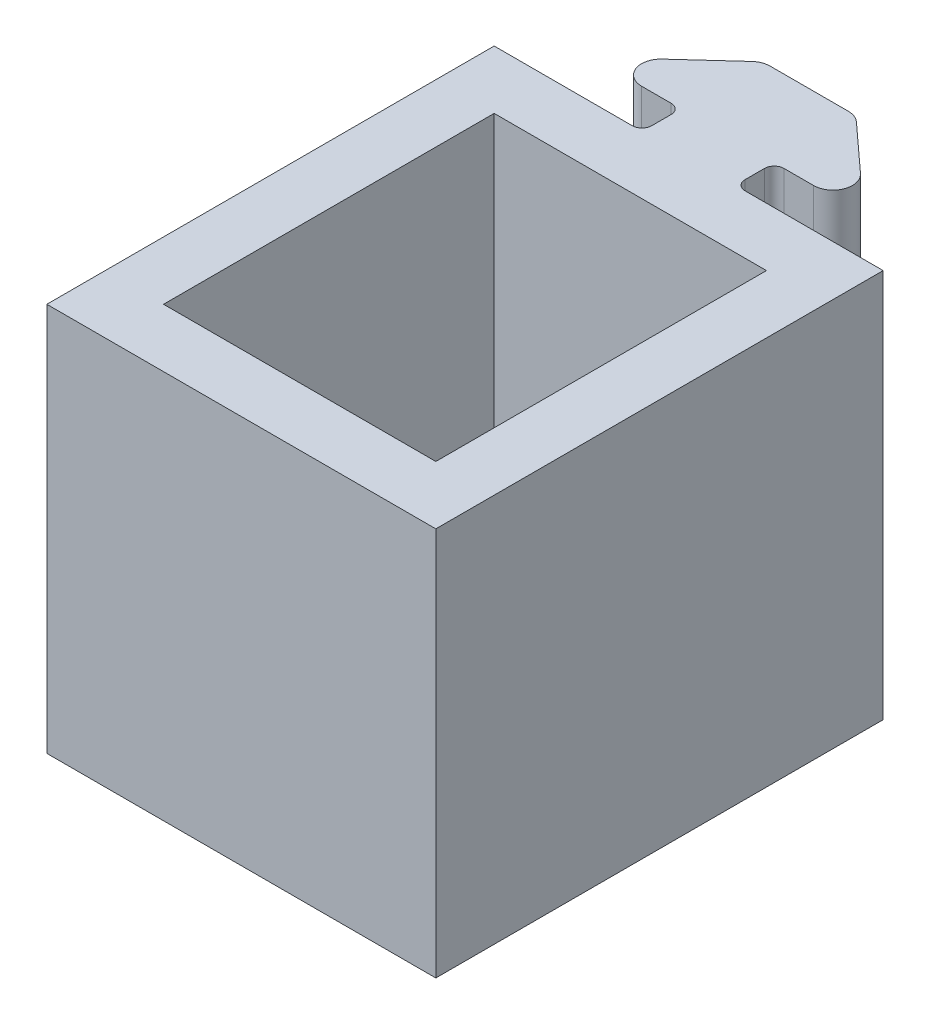
ISO-10303-21;
HEADER;
FILE_DESCRIPTION(('STEP AP214'),'2;1');
FILE_NAME('part.step','',(''),(''),'','','');
FILE_SCHEMA(('AUTOMOTIVE_DESIGN { 1 0 10303 214 1 1 1 1 }'));
ENDSEC;
DATA;
#1=APPLICATION_CONTEXT('core data for automotive mechanical design processes');
#2=APPLICATION_PROTOCOL_DEFINITION('international standard','automotive_design',2000,#1);
#3=PRODUCT_CONTEXT('',#1,'mechanical');
#4=PRODUCT('Part','Part','',(#3));
#5=PRODUCT_RELATED_PRODUCT_CATEGORY('part','',(#4));
#6=PRODUCT_DEFINITION_FORMATION('','',#4);
#7=PRODUCT_DEFINITION_CONTEXT('part definition',#1,'design');
#8=PRODUCT_DEFINITION('design','',#6,#7);
#9=PRODUCT_DEFINITION_SHAPE('','',#8);
#10=(LENGTH_UNIT() NAMED_UNIT(*) SI_UNIT(.MILLI.,.METRE.));
#11=(NAMED_UNIT(*) PLANE_ANGLE_UNIT() SI_UNIT($,.RADIAN.));
#12=(NAMED_UNIT(*) SI_UNIT($,.STERADIAN.) SOLID_ANGLE_UNIT());
#13=UNCERTAINTY_MEASURE_WITH_UNIT(LENGTH_MEASURE(1.E-05),#10,'distance_accuracy_value','');
#14=(GEOMETRIC_REPRESENTATION_CONTEXT(3) GLOBAL_UNCERTAINTY_ASSIGNED_CONTEXT((#13)) GLOBAL_UNIT_ASSIGNED_CONTEXT((#10,
#11,#12)) REPRESENTATION_CONTEXT('',''));
#15=CARTESIAN_POINT('',(0.,0.,0.));
#16=DIRECTION('',(0.,0.,1.));
#17=DIRECTION('',(1.,0.,0.));
#18=AXIS2_PLACEMENT_3D('',#15,#16,#17);
#19=CARTESIAN_POINT('',(10.,20.,4.61818181818181));
#20=DIRECTION('',(0.,0.,-1.));
#21=DIRECTION('',(-1.,0.,0.));
#22=AXIS2_PLACEMENT_3D('',#19,#20,#21);
#23=PLANE('',#22);
#24=DIRECTION('',(0.,1.,0.));
#25=VECTOR('',#24,1.);
#26=CARTESIAN_POINT('',(-7.,0.,4.61818181818181));
#27=LINE('',#26,#25);
#28=CARTESIAN_POINT('',(-7.,0.,4.61818181818181));
#29=VERTEX_POINT('',#28);
#30=CARTESIAN_POINT('',(-7.,20.,4.61818181818181));
#31=VERTEX_POINT('',#30);
#32=EDGE_CURVE('E235',#29,#31,#27,.T.);
#33=ORIENTED_EDGE('',*,*,#32,.F.);
#34=DIRECTION('',(1.,0.,0.));
#35=VECTOR('',#34,1.);
#36=CARTESIAN_POINT('',(10.,0.,4.61818181818181));
#37=LINE('',#36,#35);
#38=CARTESIAN_POINT('',(7.,0.,4.61818181818181));
#39=VERTEX_POINT('',#38);
#40=EDGE_CURVE('E289',#29,#39,#37,.T.);
#41=ORIENTED_EDGE('',*,*,#40,.T.);
#42=DIRECTION('',(0.,1.,0.));
#43=VECTOR('',#42,1.);
#44=CARTESIAN_POINT('',(7.,0.,4.61818181818181));
#45=LINE('',#44,#43);
#46=CARTESIAN_POINT('',(7.,20.,4.61818181818181));
#47=VERTEX_POINT('',#46);
#48=EDGE_CURVE('E48',#39,#47,#45,.T.);
#49=ORIENTED_EDGE('',*,*,#48,.T.);
#50=DIRECTION('',(1.,0.,0.));
#51=VECTOR('',#50,1.);
#52=CARTESIAN_POINT('',(10.,20.,4.61818181818181));
#53=LINE('',#52,#51);
#54=EDGE_CURVE('E52',#31,#47,#53,.T.);
#55=ORIENTED_EDGE('',*,*,#54,.F.);
#56=EDGE_LOOP('',(#33,#41,#49,#55));
#57=FACE_BOUND('',#56,.T.);
#58=ADVANCED_FACE('F33',(#57),#23,.F.);
#59=CARTESIAN_POINT('',(2.4,20.,-4.58181818181819));
#60=DIRECTION('',(-0.674269364021332,0.,0.738485493928126));
#61=DIRECTION('',(0.738485493928126,0.,0.674269364021332));
#62=AXIS2_PLACEMENT_3D('',#59,#60,#61);
#63=PLANE('',#62);
#64=DIRECTION('',(-0.738485493928126,0.,-0.674269364021332));
#65=VECTOR('',#64,1.);
#66=CARTESIAN_POINT('',(2.4,0.,-4.58181818181819));
#67=LINE('',#66,#65);
#68=CARTESIAN_POINT('',(5.0959444590311,0.,-2.12030367574631));
#69=VERTEX_POINT('',#68);
#70=CARTESIAN_POINT('',(2.68642064950729,0.,-4.32030367574631));
#71=VERTEX_POINT('',#70);
#72=EDGE_CURVE('E231',#69,#71,#67,.T.);
#73=ORIENTED_EDGE('',*,*,#72,.T.);
#74=DIRECTION('',(0.,-1.,0.));
#75=VECTOR('',#74,1.);
#76=CARTESIAN_POINT('',(2.68642064950729,20.,-4.32030367574631));
#77=LINE('',#76,#75);
#78=CARTESIAN_POINT('',(2.68642064950729,20.,-4.32030367574631));
#79=VERTEX_POINT('',#78);
#80=EDGE_CURVE('E322',#71,#79,#77,.F.);
#81=ORIENTED_EDGE('',*,*,#80,.T.);
#82=DIRECTION('',(-0.738485493928126,0.,-0.674269364021332));
#83=VECTOR('',#82,1.);
#84=CARTESIAN_POINT('',(2.4,20.,-4.58181818181819));
#85=LINE('',#84,#83);
#86=CARTESIAN_POINT('',(5.0959444590311,20.,-2.12030367574631));
#87=VERTEX_POINT('',#86);
#88=EDGE_CURVE('E239',#87,#79,#85,.T.);
#89=ORIENTED_EDGE('',*,*,#88,.F.);
#90=DIRECTION('',(0.,-1.,0.));
#91=VECTOR('',#90,1.);
#92=CARTESIAN_POINT('',(5.0959444590311,20.,-2.12030367574631));
#93=LINE('',#92,#91);
#94=EDGE_CURVE('E319',#87,#69,#93,.T.);
#95=ORIENTED_EDGE('',*,*,#94,.T.);
#96=EDGE_LOOP('',(#73,#81,#89,#95));
#97=FACE_BOUND('',#96,.T.);
#98=ADVANCED_FACE('F443',(#97),#63,.F.);
#99=CARTESIAN_POINT('',(-2.4,20.,-4.58181818181819));
#100=DIRECTION('',(0.,0.,1.));
#101=DIRECTION('',(1.,0.,0.));
#102=AXIS2_PLACEMENT_3D('',#99,#100,#101);
#103=PLANE('',#102);
#104=DIRECTION('',(-1.,0.,0.));
#105=VECTOR('',#104,1.);
#106=CARTESIAN_POINT('',(-2.4,20.,-4.58181818181819));
#107=LINE('',#106,#105);
#108=CARTESIAN_POINT('',(2.01215128548596,20.,-4.58181818181819));
#109=VERTEX_POINT('',#108);
#110=CARTESIAN_POINT('',(-2.01215128548596,20.,-4.58181818181819));
#111=VERTEX_POINT('',#110);
#112=EDGE_CURVE('E242',#109,#111,#107,.T.);
#113=ORIENTED_EDGE('',*,*,#112,.F.);
#114=DIRECTION('',(0.,-1.,0.));
#115=VECTOR('',#114,1.);
#116=CARTESIAN_POINT('',(2.01215128548596,20.,-4.58181818181819));
#117=LINE('',#116,#115);
#118=CARTESIAN_POINT('',(2.01215128548596,0.,-4.58181818181819));
#119=VERTEX_POINT('',#118);
#120=EDGE_CURVE('E307',#109,#119,#117,.T.);
#121=ORIENTED_EDGE('',*,*,#120,.T.);
#122=DIRECTION('',(-1.,0.,0.));
#123=VECTOR('',#122,1.);
#124=CARTESIAN_POINT('',(-2.4,0.,-4.58181818181819));
#125=LINE('',#124,#123);
#126=CARTESIAN_POINT('',(-2.01215128548596,0.,-4.58181818181819));
#127=VERTEX_POINT('',#126);
#128=EDGE_CURVE('E273',#119,#127,#125,.T.);
#129=ORIENTED_EDGE('',*,*,#128,.T.);
#130=DIRECTION('',(0.,-1.,0.));
#131=VECTOR('',#130,1.);
#132=CARTESIAN_POINT('',(-2.01215128548596,20.,-4.58181818181819));
#133=LINE('',#132,#131);
#134=EDGE_CURVE('E305',#127,#111,#133,.F.);
#135=ORIENTED_EDGE('',*,*,#134,.T.);
#136=EDGE_LOOP('',(#113,#121,#129,#135));
#137=FACE_BOUND('',#136,.T.);
#138=ADVANCED_FACE('F454',(#137),#103,.F.);
#139=CARTESIAN_POINT('',(-2.4,20.,-4.58181818181819));
#140=DIRECTION('',(0.674269364021332,0.,0.738485493928126));
#141=DIRECTION('',(0.738485493928126,0.,-0.674269364021332));
#142=AXIS2_PLACEMENT_3D('',#139,#140,#141);
#143=PLANE('',#142);
#144=DIRECTION('',(-0.738485493928126,0.,0.674269364021332));
#145=VECTOR('',#144,1.);
#146=CARTESIAN_POINT('',(-2.4,20.,-4.58181818181819));
#147=LINE('',#146,#145);
#148=CARTESIAN_POINT('',(-2.68642064950729,20.,-4.32030367574631));
#149=VERTEX_POINT('',#148);
#150=CARTESIAN_POINT('',(-5.0959444590311,20.,-2.12030367574631));
#151=VERTEX_POINT('',#150);
#152=EDGE_CURVE('E246',#149,#151,#147,.T.);
#153=ORIENTED_EDGE('',*,*,#152,.F.);
#154=DIRECTION('',(0.,-1.,0.));
#155=VECTOR('',#154,1.);
#156=CARTESIAN_POINT('',(-2.68642064950729,20.,-4.32030367574631));
#157=LINE('',#156,#155);
#158=CARTESIAN_POINT('',(-2.68642064950729,0.,-4.32030367574631));
#159=VERTEX_POINT('',#158);
#160=EDGE_CURVE('E334',#149,#159,#157,.T.);
#161=ORIENTED_EDGE('',*,*,#160,.T.);
#162=DIRECTION('',(-0.738485493928126,0.,0.674269364021332));
#163=VECTOR('',#162,1.);
#164=CARTESIAN_POINT('',(-2.4,0.,-4.58181818181819));
#165=LINE('',#164,#163);
#166=CARTESIAN_POINT('',(-5.0959444590311,0.,-2.12030367574631));
#167=VERTEX_POINT('',#166);
#168=EDGE_CURVE('E276',#159,#167,#165,.T.);
#169=ORIENTED_EDGE('',*,*,#168,.T.);
#170=DIRECTION('',(0.,-1.,0.));
#171=VECTOR('',#170,1.);
#172=CARTESIAN_POINT('',(-5.0959444590311,20.,-2.12030367574631));
#173=LINE('',#172,#171);
#174=EDGE_CURVE('E332',#167,#151,#173,.F.);
#175=ORIENTED_EDGE('',*,*,#174,.T.);
#176=EDGE_LOOP('',(#153,#161,#169,#175));
#177=FACE_BOUND('',#176,.T.);
#178=ADVANCED_FACE('F462',(#177),#143,.F.);
#179=CARTESIAN_POINT('',(-7.,20.,-0.381818181818188));
#180=DIRECTION('',(0.,0.,-1.));
#181=DIRECTION('',(-1.,0.,0.));
#182=AXIS2_PLACEMENT_3D('',#179,#180,#181);
#183=PLANE('',#182);
#184=DIRECTION('',(1.,0.,0.));
#185=VECTOR('',#184,1.);
#186=CARTESIAN_POINT('',(-7.,0.,-0.381818181818188));
#187=LINE('',#186,#185);
#188=CARTESIAN_POINT('',(-4.42167509500977,0.,-0.381818181818187));
#189=VERTEX_POINT('',#188);
#190=CARTESIAN_POINT('',(-2.9,0.,-0.381818181818187));
#191=VERTEX_POINT('',#190);
#192=EDGE_CURVE('E279',#189,#191,#187,.T.);
#193=ORIENTED_EDGE('',*,*,#192,.T.);
#194=DIRECTION('',(0.,-1.,0.));
#195=VECTOR('',#194,1.);
#196=CARTESIAN_POINT('',(-2.9,20.,-0.381818181818187));
#197=LINE('',#196,#195);
#198=CARTESIAN_POINT('',(-2.9,20.,-0.381818181818187));
#199=VERTEX_POINT('',#198);
#200=EDGE_CURVE('E361',#191,#199,#197,.F.);
#201=ORIENTED_EDGE('',*,*,#200,.T.);
#202=DIRECTION('',(1.,0.,0.));
#203=VECTOR('',#202,1.);
#204=CARTESIAN_POINT('',(-7.,20.,-0.381818181818188));
#205=LINE('',#204,#203);
#206=CARTESIAN_POINT('',(-4.42167509500977,20.,-0.381818181818187));
#207=VERTEX_POINT('',#206);
#208=EDGE_CURVE('E249',#207,#199,#205,.T.);
#209=ORIENTED_EDGE('',*,*,#208,.F.);
#210=DIRECTION('',(0.,-1.,0.));
#211=VECTOR('',#210,1.);
#212=CARTESIAN_POINT('',(-4.42167509500977,20.,-0.381818181818187));
#213=LINE('',#212,#211);
#214=EDGE_CURVE('E337',#207,#189,#213,.T.);
#215=ORIENTED_EDGE('',*,*,#214,.T.);
#216=EDGE_LOOP('',(#193,#201,#209,#215));
#217=FACE_BOUND('',#216,.T.);
#218=ADVANCED_FACE('F381',(#217),#183,.F.);
#219=CARTESIAN_POINT('',(-2.4,20.,-0.381818181818187));
#220=DIRECTION('',(1.,0.,0.));
#221=DIRECTION('',(0.,0.,-1.));
#222=AXIS2_PLACEMENT_3D('',#219,#220,#221);
#223=PLANE('',#222);
#224=DIRECTION('',(0.,0.,1.));
#225=VECTOR('',#224,1.);
#226=CARTESIAN_POINT('',(-2.4,0.,-0.381818181818187));
#227=LINE('',#226,#225);
#228=CARTESIAN_POINT('',(-2.4,0.,0.118181818181813));
#229=VERTEX_POINT('',#228);
#230=CARTESIAN_POINT('',(-2.4,0.,1.11818181818181));
#231=VERTEX_POINT('',#230);
#232=EDGE_CURVE('E282',#229,#231,#227,.T.);
#233=ORIENTED_EDGE('',*,*,#232,.T.);
#234=DIRECTION('',(0.,-1.,0.));
#235=VECTOR('',#234,1.);
#236=CARTESIAN_POINT('',(-2.4,20.,1.11818181818181));
#237=LINE('',#236,#235);
#238=CARTESIAN_POINT('',(-2.4,20.,1.11818181818181));
#239=VERTEX_POINT('',#238);
#240=EDGE_CURVE('E359',#231,#239,#237,.F.);
#241=ORIENTED_EDGE('',*,*,#240,.T.);
#242=DIRECTION('',(0.,0.,1.));
#243=VECTOR('',#242,1.);
#244=CARTESIAN_POINT('',(-2.4,20.,-0.381818181818187));
#245=LINE('',#244,#243);
#246=CARTESIAN_POINT('',(-2.4,20.,0.118181818181813));
#247=VERTEX_POINT('',#246);
#248=EDGE_CURVE('E252',#247,#239,#245,.T.);
#249=ORIENTED_EDGE('',*,*,#248,.F.);
#250=DIRECTION('',(0.,-1.,0.));
#251=VECTOR('',#250,1.);
#252=CARTESIAN_POINT('',(-2.4,0.,0.118181818181813));
#253=LINE('',#252,#251);
#254=EDGE_CURVE('E356',#247,#229,#253,.T.);
#255=ORIENTED_EDGE('',*,*,#254,.T.);
#256=EDGE_LOOP('',(#233,#241,#249,#255));
#257=FACE_BOUND('',#256,.T.);
#258=ADVANCED_FACE('F391',(#257),#223,.F.);
#259=CARTESIAN_POINT('',(-2.4,20.,1.61818181818181));
#260=DIRECTION('',(0.,0.,1.));
#261=DIRECTION('',(1.,0.,0.));
#262=AXIS2_PLACEMENT_3D('',#259,#260,#261);
#263=PLANE('',#262);
#264=DIRECTION('',(-1.,0.,0.));
#265=VECTOR('',#264,1.);
#266=CARTESIAN_POINT('',(-2.4,20.,1.61818181818181));
#267=LINE('',#266,#265);
#268=CARTESIAN_POINT('',(-2.9,20.,1.61818181818181));
#269=VERTEX_POINT('',#268);
#270=CARTESIAN_POINT('',(-10.,20.,1.61818181818181));
#271=VERTEX_POINT('',#270);
#272=EDGE_CURVE('E255',#269,#271,#267,.T.);
#273=ORIENTED_EDGE('',*,*,#272,.F.);
#274=DIRECTION('',(0.,-1.,0.));
#275=VECTOR('',#274,1.);
#276=CARTESIAN_POINT('',(-2.9,0.,1.61818181818181));
#277=LINE('',#276,#275);
#278=CARTESIAN_POINT('',(-2.9,0.,1.61818181818181));
#279=VERTEX_POINT('',#278);
#280=EDGE_CURVE('E353',#269,#279,#277,.T.);
#281=ORIENTED_EDGE('',*,*,#280,.T.);
#282=DIRECTION('',(-1.,0.,0.));
#283=VECTOR('',#282,1.);
#284=CARTESIAN_POINT('',(-2.4,0.,1.61818181818181));
#285=LINE('',#284,#283);
#286=CARTESIAN_POINT('',(-10.,0.,1.61818181818181));
#287=VERTEX_POINT('',#286);
#288=EDGE_CURVE('E285',#279,#287,#285,.T.);
#289=ORIENTED_EDGE('',*,*,#288,.T.);
#290=DIRECTION('',(0.,-1.,0.));
#291=VECTOR('',#290,1.);
#292=CARTESIAN_POINT('',(-10.,20.,1.61818181818181));
#293=LINE('',#292,#291);
#294=EDGE_CURVE('E302',#271,#287,#293,.T.);
#295=ORIENTED_EDGE('',*,*,#294,.F.);
#296=EDGE_LOOP('',(#273,#281,#289,#295));
#297=FACE_BOUND('',#296,.T.);
#298=ADVANCED_FACE('F399',(#297),#263,.F.);
#299=CARTESIAN_POINT('',(-10.,20.,1.61818181818181));
#300=DIRECTION('',(1.,0.,0.));
#301=DIRECTION('',(0.,0.,-1.));
#302=AXIS2_PLACEMENT_3D('',#299,#300,#301);
#303=PLANE('',#302);
#304=DIRECTION('',(0.,0.,1.));
#305=VECTOR('',#304,1.);
#306=CARTESIAN_POINT('',(-10.,0.,1.61818181818181));
#307=LINE('',#306,#305);
#308=CARTESIAN_POINT('',(-10.,0.,24.6181818181818));
#309=VERTEX_POINT('',#308);
#310=EDGE_CURVE('E287',#287,#309,#307,.T.);
#311=ORIENTED_EDGE('',*,*,#310,.T.);
#312=DIRECTION('',(0.,1.,0.));
#313=VECTOR('',#312,1.);
#314=CARTESIAN_POINT('',(-10.,0.,24.6181818181818));
#315=LINE('',#314,#313);
#316=CARTESIAN_POINT('',(-10.,20.,24.6181818181818));
#317=VERTEX_POINT('',#316);
#318=EDGE_CURVE('E232',#309,#317,#315,.T.);
#319=ORIENTED_EDGE('',*,*,#318,.T.);
#320=DIRECTION('',(0.,0.,1.));
#321=VECTOR('',#320,1.);
#322=CARTESIAN_POINT('',(-10.,20.,1.61818181818181));
#323=LINE('',#322,#321);
#324=EDGE_CURVE('E257',#271,#317,#323,.T.);
#325=ORIENTED_EDGE('',*,*,#324,.F.);
#326=ORIENTED_EDGE('',*,*,#294,.T.);
#327=EDGE_LOOP('',(#311,#319,#325,#326));
#328=FACE_BOUND('',#327,.T.);
#329=ADVANCED_FACE('F404',(#328),#303,.F.);
#330=CARTESIAN_POINT('',(10.,20.,1.61818181818181));
#331=DIRECTION('',(-1.,0.,0.));
#332=DIRECTION('',(0.,0.,1.));
#333=AXIS2_PLACEMENT_3D('',#330,#331,#332);
#334=PLANE('',#333);
#335=DIRECTION('',(0.,0.,-1.));
#336=VECTOR('',#335,1.);
#337=CARTESIAN_POINT('',(10.,0.,1.61818181818181));
#338=LINE('',#337,#336);
#339=CARTESIAN_POINT('',(10.,0.,24.6181818181818));
#340=VERTEX_POINT('',#339);
#341=CARTESIAN_POINT('',(10.,0.,1.61818181818181));
#342=VERTEX_POINT('',#341);
#343=EDGE_CURVE('E291',#340,#342,#338,.T.);
#344=ORIENTED_EDGE('',*,*,#343,.T.);
#345=DIRECTION('',(0.,-1.,0.));
#346=VECTOR('',#345,1.);
#347=CARTESIAN_POINT('',(10.,20.,1.61818181818181));
#348=LINE('',#347,#346);
#349=CARTESIAN_POINT('',(10.,20.,1.61818181818181));
#350=VERTEX_POINT('',#349);
#351=EDGE_CURVE('E270',#350,#342,#348,.T.);
#352=ORIENTED_EDGE('',*,*,#351,.F.);
#353=DIRECTION('',(0.,0.,-1.));
#354=VECTOR('',#353,1.);
#355=CARTESIAN_POINT('',(10.,20.,1.61818181818181));
#356=LINE('',#355,#354);
#357=CARTESIAN_POINT('',(10.,20.,24.6181818181818));
#358=VERTEX_POINT('',#357);
#359=EDGE_CURVE('E260',#358,#350,#356,.T.);
#360=ORIENTED_EDGE('',*,*,#359,.F.);
#361=DIRECTION('',(0.,1.,0.));
#362=VECTOR('',#361,1.);
#363=CARTESIAN_POINT('',(10.,0.,24.6181818181818));
#364=LINE('',#363,#362);
#365=EDGE_CURVE('E228',#340,#358,#364,.T.);
#366=ORIENTED_EDGE('',*,*,#365,.F.);
#367=EDGE_LOOP('',(#344,#352,#360,#366));
#368=FACE_BOUND('',#367,.T.);
#369=ADVANCED_FACE('F413',(#368),#334,.F.);
#370=CARTESIAN_POINT('',(2.4,20.,1.61818181818181));
#371=DIRECTION('',(0.,0.,1.));
#372=DIRECTION('',(1.,0.,0.));
#373=AXIS2_PLACEMENT_3D('',#370,#371,#372);
#374=PLANE('',#373);
#375=DIRECTION('',(-1.,0.,0.));
#376=VECTOR('',#375,1.);
#377=CARTESIAN_POINT('',(2.4,0.,1.61818181818181));
#378=LINE('',#377,#376);
#379=CARTESIAN_POINT('',(2.9,0.,1.61818181818181));
#380=VERTEX_POINT('',#379);
#381=EDGE_CURVE('E293',#342,#380,#378,.T.);
#382=ORIENTED_EDGE('',*,*,#381,.T.);
#383=DIRECTION('',(0.,-1.,0.));
#384=VECTOR('',#383,1.);
#385=CARTESIAN_POINT('',(2.9,20.,1.61818181818181));
#386=LINE('',#385,#384);
#387=CARTESIAN_POINT('',(2.9,20.,1.61818181818181));
#388=VERTEX_POINT('',#387);
#389=EDGE_CURVE('E348',#380,#388,#386,.F.);
#390=ORIENTED_EDGE('',*,*,#389,.T.);
#391=DIRECTION('',(-1.,0.,0.));
#392=VECTOR('',#391,1.);
#393=CARTESIAN_POINT('',(2.4,20.,1.61818181818181));
#394=LINE('',#393,#392);
#395=EDGE_CURVE('E262',#350,#388,#394,.T.);
#396=ORIENTED_EDGE('',*,*,#395,.F.);
#397=ORIENTED_EDGE('',*,*,#351,.T.);
#398=EDGE_LOOP('',(#382,#390,#396,#397));
#399=FACE_BOUND('',#398,.T.);
#400=ADVANCED_FACE('F417',(#399),#374,.F.);
#401=CARTESIAN_POINT('',(2.4,20.,-0.381818181818187));
#402=DIRECTION('',(-1.,0.,0.));
#403=DIRECTION('',(0.,0.,1.));
#404=AXIS2_PLACEMENT_3D('',#401,#402,#403);
#405=PLANE('',#404);
#406=DIRECTION('',(0.,0.,-1.));
#407=VECTOR('',#406,1.);
#408=CARTESIAN_POINT('',(2.4,20.,-0.381818181818187));
#409=LINE('',#408,#407);
#410=CARTESIAN_POINT('',(2.4,20.,1.11818181818181));
#411=VERTEX_POINT('',#410);
#412=CARTESIAN_POINT('',(2.4,20.,0.118181818181813));
#413=VERTEX_POINT('',#412);
#414=EDGE_CURVE('E265',#411,#413,#409,.T.);
#415=ORIENTED_EDGE('',*,*,#414,.F.);
#416=DIRECTION('',(0.,-1.,0.));
#417=VECTOR('',#416,1.);
#418=CARTESIAN_POINT('',(2.4,0.,1.11818181818181));
#419=LINE('',#418,#417);
#420=CARTESIAN_POINT('',(2.4,0.,1.11818181818181));
#421=VERTEX_POINT('',#420);
#422=EDGE_CURVE('E345',#411,#421,#419,.T.);
#423=ORIENTED_EDGE('',*,*,#422,.T.);
#424=DIRECTION('',(0.,0.,-1.));
#425=VECTOR('',#424,1.);
#426=CARTESIAN_POINT('',(2.4,0.,-0.381818181818187));
#427=LINE('',#426,#425);
#428=CARTESIAN_POINT('',(2.4,0.,0.118181818181813));
#429=VERTEX_POINT('',#428);
#430=EDGE_CURVE('E296',#421,#429,#427,.T.);
#431=ORIENTED_EDGE('',*,*,#430,.T.);
#432=DIRECTION('',(0.,-1.,0.));
#433=VECTOR('',#432,1.);
#434=CARTESIAN_POINT('',(2.4,20.,0.118181818181813));
#435=LINE('',#434,#433);
#436=EDGE_CURVE('E343',#429,#413,#435,.F.);
#437=ORIENTED_EDGE('',*,*,#436,.T.);
#438=EDGE_LOOP('',(#415,#423,#431,#437));
#439=FACE_BOUND('',#438,.T.);
#440=ADVANCED_FACE('F426',(#439),#405,.F.);
#441=CARTESIAN_POINT('',(7.,20.,-0.381818181818188));
#442=DIRECTION('',(0.,0.,-1.));
#443=DIRECTION('',(-1.,0.,0.));
#444=AXIS2_PLACEMENT_3D('',#441,#442,#443);
#445=PLANE('',#444);
#446=DIRECTION('',(1.,0.,0.));
#447=VECTOR('',#446,1.);
#448=CARTESIAN_POINT('',(7.,20.,-0.381818181818188));
#449=LINE('',#448,#447);
#450=CARTESIAN_POINT('',(2.9,20.,-0.381818181818187));
#451=VERTEX_POINT('',#450);
#452=CARTESIAN_POINT('',(4.42167509500977,20.,-0.381818181818187));
#453=VERTEX_POINT('',#452);
#454=EDGE_CURVE('E268',#451,#453,#449,.T.);
#455=ORIENTED_EDGE('',*,*,#454,.F.);
#456=DIRECTION('',(0.,-1.,0.));
#457=VECTOR('',#456,1.);
#458=CARTESIAN_POINT('',(2.9,0.,-0.381818181818187));
#459=LINE('',#458,#457);
#460=CARTESIAN_POINT('',(2.9,0.,-0.381818181818187));
#461=VERTEX_POINT('',#460);
#462=EDGE_CURVE('E350',#451,#461,#459,.T.);
#463=ORIENTED_EDGE('',*,*,#462,.T.);
#464=DIRECTION('',(1.,0.,0.));
#465=VECTOR('',#464,1.);
#466=CARTESIAN_POINT('',(7.,0.,-0.381818181818188));
#467=LINE('',#466,#465);
#468=CARTESIAN_POINT('',(4.42167509500977,0.,-0.381818181818187));
#469=VERTEX_POINT('',#468);
#470=EDGE_CURVE('E243',#461,#469,#467,.T.);
#471=ORIENTED_EDGE('',*,*,#470,.T.);
#472=DIRECTION('',(0.,-1.,0.));
#473=VECTOR('',#472,1.);
#474=CARTESIAN_POINT('',(4.42167509500977,20.,-0.381818181818187));
#475=LINE('',#474,#473);
#476=EDGE_CURVE('E340',#469,#453,#475,.F.);
#477=ORIENTED_EDGE('',*,*,#476,.T.);
#478=EDGE_LOOP('',(#455,#463,#471,#477));
#479=FACE_BOUND('',#478,.T.);
#480=ADVANCED_FACE('F435',(#479),#445,.F.);
#481=CARTESIAN_POINT('',(0.,20.,0.));
#482=DIRECTION('',(0.,-1.,0.));
#483=DIRECTION('',(0.,0.,-1.));
#484=AXIS2_PLACEMENT_3D('',#481,#482,#483);
#485=PLANE('',#484);
#486=DIRECTION('',(1.,0.,0.));
#487=VECTOR('',#486,1.);
#488=CARTESIAN_POINT('',(0.,20.,24.6181818181818));
#489=LINE('',#488,#487);
#490=EDGE_CURVE('E214',#317,#358,#489,.T.);
#491=ORIENTED_EDGE('',*,*,#490,.T.);
#492=ORIENTED_EDGE('',*,*,#359,.T.);
#493=ORIENTED_EDGE('',*,*,#395,.T.);
#494=CARTESIAN_POINT('',(2.9,20.,1.11818181818181));
#495=DIRECTION('',(0.,-1.,0.));
#496=DIRECTION('',(0.,0.,-1.));
#497=AXIS2_PLACEMENT_3D('',#494,#495,#496);
#498=CIRCLE('',#497,0.5);
#499=EDGE_CURVE('E365',#388,#411,#498,.T.);
#500=ORIENTED_EDGE('',*,*,#499,.T.);
#501=ORIENTED_EDGE('',*,*,#414,.T.);
#502=CARTESIAN_POINT('',(2.9,20.,0.118181818181813));
#503=DIRECTION('',(0.,-1.,0.));
#504=DIRECTION('',(0.,0.,-1.));
#505=AXIS2_PLACEMENT_3D('',#502,#503,#504);
#506=CIRCLE('',#505,0.5);
#507=EDGE_CURVE('E369',#413,#451,#506,.T.);
#508=ORIENTED_EDGE('',*,*,#507,.T.);
#509=ORIENTED_EDGE('',*,*,#454,.T.);
#510=CARTESIAN_POINT('',(4.42167509500977,20.,-1.38181818181819));
#511=DIRECTION('',(0.,-1.,0.));
#512=DIRECTION('',(0.,0.,-1.));
#513=AXIS2_PLACEMENT_3D('',#510,#511,#512);
#514=CIRCLE('',#513,1.);
#515=EDGE_CURVE('E324',#453,#87,#514,.F.);
#516=ORIENTED_EDGE('',*,*,#515,.T.);
#517=ORIENTED_EDGE('',*,*,#88,.T.);
#518=CARTESIAN_POINT('',(2.01215128548596,20.,-3.58181818181819));
#519=DIRECTION('',(0.,-1.,0.));
#520=DIRECTION('',(0.,0.,-1.));
#521=AXIS2_PLACEMENT_3D('',#518,#519,#520);
#522=CIRCLE('',#521,1.);
#523=EDGE_CURVE('E330',#79,#109,#522,.F.);
#524=ORIENTED_EDGE('',*,*,#523,.T.);
#525=ORIENTED_EDGE('',*,*,#112,.T.);
#526=CARTESIAN_POINT('',(-2.01215128548596,20.,-3.58181818181819));
#527=DIRECTION('',(0.,-1.,0.));
#528=DIRECTION('',(0.,0.,-1.));
#529=AXIS2_PLACEMENT_3D('',#526,#527,#528);
#530=CIRCLE('',#529,1.);
#531=EDGE_CURVE('E328',#111,#149,#530,.F.);
#532=ORIENTED_EDGE('',*,*,#531,.T.);
#533=ORIENTED_EDGE('',*,*,#152,.T.);
#534=CARTESIAN_POINT('',(-4.42167509500977,20.,-1.38181818181819));
#535=DIRECTION('',(0.,-1.,0.));
#536=DIRECTION('',(0.,0.,-1.));
#537=AXIS2_PLACEMENT_3D('',#534,#535,#536);
#538=CIRCLE('',#537,1.);
#539=EDGE_CURVE('E326',#151,#207,#538,.F.);
#540=ORIENTED_EDGE('',*,*,#539,.T.);
#541=ORIENTED_EDGE('',*,*,#208,.T.);
#542=CARTESIAN_POINT('',(-2.9,20.,0.118181818181813));
#543=DIRECTION('',(0.,-1.,0.));
#544=DIRECTION('',(0.,0.,-1.));
#545=AXIS2_PLACEMENT_3D('',#542,#543,#544);
#546=CIRCLE('',#545,0.5);
#547=EDGE_CURVE('E11',#199,#247,#546,.T.);
#548=ORIENTED_EDGE('',*,*,#547,.T.);
#549=ORIENTED_EDGE('',*,*,#248,.T.);
#550=CARTESIAN_POINT('',(-2.9,20.,1.11818181818181));
#551=DIRECTION('',(0.,-1.,0.));
#552=DIRECTION('',(0.,0.,-1.));
#553=AXIS2_PLACEMENT_3D('',#550,#551,#552);
#554=CIRCLE('',#553,0.5);
#555=EDGE_CURVE('E373',#239,#269,#554,.T.);
#556=ORIENTED_EDGE('',*,*,#555,.T.);
#557=ORIENTED_EDGE('',*,*,#272,.T.);
#558=ORIENTED_EDGE('',*,*,#324,.T.);
#559=EDGE_LOOP('',(#491,#492,#493,#500,#501,#508,#509,#516,#517,#524,#525,#532,#533,#540,#541,
#548,#549,#556,#557,#558));
#560=FACE_BOUND('',#559,.T.);
#561=ORIENTED_EDGE('',*,*,#54,.T.);
#562=DIRECTION('',(0.,0.,1.));
#563=VECTOR('',#562,1.);
#564=CARTESIAN_POINT('',(7.,20.,0.));
#565=LINE('',#564,#563);
#566=CARTESIAN_POINT('',(7.,20.,21.6181818181818));
#567=VERTEX_POINT('',#566);
#568=EDGE_CURVE('E224',#47,#567,#565,.T.);
#569=ORIENTED_EDGE('',*,*,#568,.T.);
#570=DIRECTION('',(1.,0.,0.));
#571=VECTOR('',#570,1.);
#572=CARTESIAN_POINT('',(0.,20.,21.6181818181818));
#573=LINE('',#572,#571);
#574=CARTESIAN_POINT('',(-7.,20.,21.6181818181818));
#575=VERTEX_POINT('',#574);
#576=EDGE_CURVE('E207',#575,#567,#573,.T.);
#577=ORIENTED_EDGE('',*,*,#576,.F.);
#578=DIRECTION('',(0.,0.,1.));
#579=VECTOR('',#578,1.);
#580=CARTESIAN_POINT('',(-7.,20.,0.));
#581=LINE('',#580,#579);
#582=EDGE_CURVE('E217',#31,#575,#581,.T.);
#583=ORIENTED_EDGE('',*,*,#582,.F.);
#584=EDGE_LOOP('',(#561,#569,#577,#583));
#585=FACE_BOUND('',#584,.T.);
#586=ADVANCED_FACE('F387',(#560,#585),#485,.F.);
#587=CARTESIAN_POINT('',(0.,0.,0.));
#588=DIRECTION('',(0.,-1.,0.));
#589=DIRECTION('',(0.,0.,-1.));
#590=AXIS2_PLACEMENT_3D('',#587,#588,#589);
#591=PLANE('',#590);
#592=ORIENTED_EDGE('',*,*,#343,.F.);
#593=DIRECTION('',(1.,0.,0.));
#594=VECTOR('',#593,1.);
#595=CARTESIAN_POINT('',(0.,0.,24.6181818181818));
#596=LINE('',#595,#594);
#597=EDGE_CURVE('E221',#309,#340,#596,.T.);
#598=ORIENTED_EDGE('',*,*,#597,.F.);
#599=ORIENTED_EDGE('',*,*,#310,.F.);
#600=ORIENTED_EDGE('',*,*,#288,.F.);
#601=CARTESIAN_POINT('',(-2.9,0.,1.11818181818181));
#602=DIRECTION('',(0.,-1.,0.));
#603=DIRECTION('',(0.,0.,-1.));
#604=AXIS2_PLACEMENT_3D('',#601,#602,#603);
#605=CIRCLE('',#604,0.5);
#606=EDGE_CURVE('E371',#279,#231,#605,.F.);
#607=ORIENTED_EDGE('',*,*,#606,.T.);
#608=ORIENTED_EDGE('',*,*,#232,.F.);
#609=CARTESIAN_POINT('',(-2.9,0.,0.118181818181813));
#610=DIRECTION('',(0.,-1.,0.));
#611=DIRECTION('',(0.,0.,-1.));
#612=AXIS2_PLACEMENT_3D('',#609,#610,#611);
#613=CIRCLE('',#612,0.5);
#614=EDGE_CURVE('E41',#229,#191,#613,.F.);
#615=ORIENTED_EDGE('',*,*,#614,.T.);
#616=ORIENTED_EDGE('',*,*,#192,.F.);
#617=CARTESIAN_POINT('',(-4.42167509500977,0.,-1.38181818181819));
#618=DIRECTION('',(0.,-1.,0.));
#619=DIRECTION('',(0.,0.,-1.));
#620=AXIS2_PLACEMENT_3D('',#617,#618,#619);
#621=CIRCLE('',#620,1.);
#622=EDGE_CURVE('E313',#189,#167,#621,.T.);
#623=ORIENTED_EDGE('',*,*,#622,.T.);
#624=ORIENTED_EDGE('',*,*,#168,.F.);
#625=CARTESIAN_POINT('',(-2.01215128548596,0.,-3.58181818181819));
#626=DIRECTION('',(0.,-1.,0.));
#627=DIRECTION('',(0.,0.,-1.));
#628=AXIS2_PLACEMENT_3D('',#625,#626,#627);
#629=CIRCLE('',#628,1.);
#630=EDGE_CURVE('E315',#159,#127,#629,.T.);
#631=ORIENTED_EDGE('',*,*,#630,.T.);
#632=ORIENTED_EDGE('',*,*,#128,.F.);
#633=CARTESIAN_POINT('',(2.01215128548596,0.,-3.58181818181819));
#634=DIRECTION('',(0.,-1.,0.));
#635=DIRECTION('',(0.,0.,-1.));
#636=AXIS2_PLACEMENT_3D('',#633,#634,#635);
#637=CIRCLE('',#636,1.);
#638=EDGE_CURVE('E317',#119,#71,#637,.T.);
#639=ORIENTED_EDGE('',*,*,#638,.T.);
#640=ORIENTED_EDGE('',*,*,#72,.F.);
#641=CARTESIAN_POINT('',(4.42167509500977,0.,-1.38181818181819));
#642=DIRECTION('',(0.,-1.,0.));
#643=DIRECTION('',(0.,0.,-1.));
#644=AXIS2_PLACEMENT_3D('',#641,#642,#643);
#645=CIRCLE('',#644,1.);
#646=EDGE_CURVE('E310',#69,#469,#645,.T.);
#647=ORIENTED_EDGE('',*,*,#646,.T.);
#648=ORIENTED_EDGE('',*,*,#470,.F.);
#649=CARTESIAN_POINT('',(2.9,0.,0.118181818181813));
#650=DIRECTION('',(0.,-1.,0.));
#651=DIRECTION('',(0.,0.,-1.));
#652=AXIS2_PLACEMENT_3D('',#649,#650,#651);
#653=CIRCLE('',#652,0.5);
#654=EDGE_CURVE('E367',#461,#429,#653,.F.);
#655=ORIENTED_EDGE('',*,*,#654,.T.);
#656=ORIENTED_EDGE('',*,*,#430,.F.);
#657=CARTESIAN_POINT('',(2.9,0.,1.11818181818181));
#658=DIRECTION('',(0.,-1.,0.));
#659=DIRECTION('',(0.,0.,-1.));
#660=AXIS2_PLACEMENT_3D('',#657,#658,#659);
#661=CIRCLE('',#660,0.5);
#662=EDGE_CURVE('E363',#421,#380,#661,.F.);
#663=ORIENTED_EDGE('',*,*,#662,.T.);
#664=ORIENTED_EDGE('',*,*,#381,.F.);
#665=EDGE_LOOP('',(#592,#598,#599,#600,#607,#608,#615,#616,#623,#624,#631,#632,#639,#640,#647,
#648,#655,#656,#663,#664));
#666=FACE_BOUND('',#665,.T.);
#667=DIRECTION('',(0.,0.,1.));
#668=VECTOR('',#667,1.);
#669=CARTESIAN_POINT('',(7.,0.,0.));
#670=LINE('',#669,#668);
#671=CARTESIAN_POINT('',(7.,0.,21.6181818181818));
#672=VERTEX_POINT('',#671);
#673=EDGE_CURVE('E196',#39,#672,#670,.T.);
#674=ORIENTED_EDGE('',*,*,#673,.F.);
#675=ORIENTED_EDGE('',*,*,#40,.F.);
#676=DIRECTION('',(0.,0.,1.));
#677=VECTOR('',#676,1.);
#678=CARTESIAN_POINT('',(-7.,0.,0.));
#679=LINE('',#678,#677);
#680=CARTESIAN_POINT('',(-7.,0.,21.6181818181818));
#681=VERTEX_POINT('',#680);
#682=EDGE_CURVE('E198',#29,#681,#679,.T.);
#683=ORIENTED_EDGE('',*,*,#682,.T.);
#684=DIRECTION('',(1.,0.,0.));
#685=VECTOR('',#684,1.);
#686=CARTESIAN_POINT('',(0.,0.,21.6181818181818));
#687=LINE('',#686,#685);
#688=EDGE_CURVE('E192',#681,#672,#687,.T.);
#689=ORIENTED_EDGE('',*,*,#688,.T.);
#690=EDGE_LOOP('',(#674,#675,#683,#689));
#691=FACE_BOUND('',#690,.T.);
#692=ADVANCED_FACE('F194',(#666,#691),#591,.T.);
#693=CARTESIAN_POINT('',(2.01215128548596,20.,-3.58181818181819));
#694=DIRECTION('',(0.,-1.,0.));
#695=DIRECTION('',(0.,0.,-1.));
#696=AXIS2_PLACEMENT_3D('',#693,#694,#695);
#697=CYLINDRICAL_SURFACE('',#696,1.);
#698=ORIENTED_EDGE('',*,*,#523,.F.);
#699=ORIENTED_EDGE('',*,*,#80,.F.);
#700=ORIENTED_EDGE('',*,*,#638,.F.);
#701=ORIENTED_EDGE('',*,*,#120,.F.);
#702=EDGE_LOOP('',(#698,#699,#700,#701));
#703=FACE_BOUND('',#702,.T.);
#704=ADVANCED_FACE('F449',(#703),#697,.T.);
#705=CARTESIAN_POINT('',(-2.01215128548596,20.,-3.58181818181819));
#706=DIRECTION('',(0.,-1.,0.));
#707=DIRECTION('',(0.,0.,-1.));
#708=AXIS2_PLACEMENT_3D('',#705,#706,#707);
#709=CYLINDRICAL_SURFACE('',#708,1.);
#710=ORIENTED_EDGE('',*,*,#531,.F.);
#711=ORIENTED_EDGE('',*,*,#134,.F.);
#712=ORIENTED_EDGE('',*,*,#630,.F.);
#713=ORIENTED_EDGE('',*,*,#160,.F.);
#714=EDGE_LOOP('',(#710,#711,#712,#713));
#715=FACE_BOUND('',#714,.T.);
#716=ADVANCED_FACE('F457',(#715),#709,.T.);
#717=CARTESIAN_POINT('',(-4.42167509500977,20.,-1.38181818181819));
#718=DIRECTION('',(0.,-1.,0.));
#719=DIRECTION('',(0.,0.,-1.));
#720=AXIS2_PLACEMENT_3D('',#717,#718,#719);
#721=CYLINDRICAL_SURFACE('',#720,1.);
#722=ORIENTED_EDGE('',*,*,#539,.F.);
#723=ORIENTED_EDGE('',*,*,#174,.F.);
#724=ORIENTED_EDGE('',*,*,#622,.F.);
#725=ORIENTED_EDGE('',*,*,#214,.F.);
#726=EDGE_LOOP('',(#722,#723,#724,#725));
#727=FACE_BOUND('',#726,.T.);
#728=ADVANCED_FACE('F466',(#727),#721,.T.);
#729=CARTESIAN_POINT('',(4.42167509500977,20.,-1.38181818181819));
#730=DIRECTION('',(0.,-1.,0.));
#731=DIRECTION('',(0.,0.,-1.));
#732=AXIS2_PLACEMENT_3D('',#729,#730,#731);
#733=CYLINDRICAL_SURFACE('',#732,1.);
#734=ORIENTED_EDGE('',*,*,#515,.F.);
#735=ORIENTED_EDGE('',*,*,#476,.F.);
#736=ORIENTED_EDGE('',*,*,#646,.F.);
#737=ORIENTED_EDGE('',*,*,#94,.F.);
#738=EDGE_LOOP('',(#734,#735,#736,#737));
#739=FACE_BOUND('',#738,.T.);
#740=ADVANCED_FACE('F446',(#739),#733,.T.);
#741=CARTESIAN_POINT('',(2.9,20.,1.11818181818181));
#742=DIRECTION('',(0.,1.,0.));
#743=DIRECTION('',(0.,0.,1.));
#744=AXIS2_PLACEMENT_3D('',#741,#742,#743);
#745=CYLINDRICAL_SURFACE('',#744,0.5);
#746=ORIENTED_EDGE('',*,*,#499,.F.);
#747=ORIENTED_EDGE('',*,*,#389,.F.);
#748=ORIENTED_EDGE('',*,*,#662,.F.);
#749=ORIENTED_EDGE('',*,*,#422,.F.);
#750=EDGE_LOOP('',(#746,#747,#748,#749));
#751=FACE_BOUND('',#750,.T.);
#752=ADVANCED_FACE('F423',(#751),#745,.F.);
#753=CARTESIAN_POINT('',(2.9,20.,0.118181818181813));
#754=DIRECTION('',(0.,1.,0.));
#755=DIRECTION('',(0.,0.,1.));
#756=AXIS2_PLACEMENT_3D('',#753,#754,#755);
#757=CYLINDRICAL_SURFACE('',#756,0.5);
#758=ORIENTED_EDGE('',*,*,#507,.F.);
#759=ORIENTED_EDGE('',*,*,#436,.F.);
#760=ORIENTED_EDGE('',*,*,#654,.F.);
#761=ORIENTED_EDGE('',*,*,#462,.F.);
#762=EDGE_LOOP('',(#758,#759,#760,#761));
#763=FACE_BOUND('',#762,.T.);
#764=ADVANCED_FACE('F432',(#763),#757,.F.);
#765=CARTESIAN_POINT('',(-2.9,20.,1.11818181818181));
#766=DIRECTION('',(0.,1.,0.));
#767=DIRECTION('',(0.,0.,1.));
#768=AXIS2_PLACEMENT_3D('',#765,#766,#767);
#769=CYLINDRICAL_SURFACE('',#768,0.5);
#770=ORIENTED_EDGE('',*,*,#555,.F.);
#771=ORIENTED_EDGE('',*,*,#240,.F.);
#772=ORIENTED_EDGE('',*,*,#606,.F.);
#773=ORIENTED_EDGE('',*,*,#280,.F.);
#774=EDGE_LOOP('',(#770,#771,#772,#773));
#775=FACE_BOUND('',#774,.T.);
#776=ADVANCED_FACE('F394',(#775),#769,.F.);
#777=CARTESIAN_POINT('',(-2.9,20.,0.118181818181813));
#778=DIRECTION('',(0.,1.,0.));
#779=DIRECTION('',(0.,0.,1.));
#780=AXIS2_PLACEMENT_3D('',#777,#778,#779);
#781=CYLINDRICAL_SURFACE('',#780,0.5);
#782=ORIENTED_EDGE('',*,*,#547,.F.);
#783=ORIENTED_EDGE('',*,*,#200,.F.);
#784=ORIENTED_EDGE('',*,*,#614,.F.);
#785=ORIENTED_EDGE('',*,*,#254,.F.);
#786=EDGE_LOOP('',(#782,#783,#784,#785));
#787=FACE_BOUND('',#786,.T.);
#788=ADVANCED_FACE('F35',(#787),#781,.F.);
#789=CARTESIAN_POINT('',(0.,0.,24.6181818181818));
#790=DIRECTION('',(0.,0.,1.));
#791=DIRECTION('',(1.,0.,0.));
#792=AXIS2_PLACEMENT_3D('',#789,#790,#791);
#793=PLANE('',#792);
#794=ORIENTED_EDGE('',*,*,#490,.F.);
#795=ORIENTED_EDGE('',*,*,#318,.F.);
#796=ORIENTED_EDGE('',*,*,#597,.T.);
#797=ORIENTED_EDGE('',*,*,#365,.T.);
#798=EDGE_LOOP('',(#794,#795,#796,#797));
#799=FACE_BOUND('',#798,.T.);
#800=ADVANCED_FACE('F409',(#799),#793,.T.);
#801=CARTESIAN_POINT('',(-7.,0.,0.));
#802=DIRECTION('',(-1.,0.,0.));
#803=DIRECTION('',(0.,0.,1.));
#804=AXIS2_PLACEMENT_3D('',#801,#802,#803);
#805=PLANE('',#804);
#806=ORIENTED_EDGE('',*,*,#582,.T.);
#807=DIRECTION('',(0.,1.,0.));
#808=VECTOR('',#807,1.);
#809=CARTESIAN_POINT('',(-7.,0.,21.6181818181818));
#810=LINE('',#809,#808);
#811=EDGE_CURVE('E211',#681,#575,#810,.T.);
#812=ORIENTED_EDGE('',*,*,#811,.F.);
#813=ORIENTED_EDGE('',*,*,#682,.F.);
#814=ORIENTED_EDGE('',*,*,#32,.T.);
#815=EDGE_LOOP('',(#806,#812,#813,#814));
#816=FACE_BOUND('',#815,.T.);
#817=ADVANCED_FACE('F539',(#816),#805,.F.);
#818=CARTESIAN_POINT('',(0.,0.,21.6181818181818));
#819=DIRECTION('',(0.,0.,1.));
#820=DIRECTION('',(1.,0.,0.));
#821=AXIS2_PLACEMENT_3D('',#818,#819,#820);
#822=PLANE('',#821);
#823=ORIENTED_EDGE('',*,*,#576,.T.);
#824=DIRECTION('',(0.,1.,0.));
#825=VECTOR('',#824,1.);
#826=CARTESIAN_POINT('',(7.,0.,21.6181818181818));
#827=LINE('',#826,#825);
#828=EDGE_CURVE('E204',#672,#567,#827,.T.);
#829=ORIENTED_EDGE('',*,*,#828,.F.);
#830=ORIENTED_EDGE('',*,*,#688,.F.);
#831=ORIENTED_EDGE('',*,*,#811,.T.);
#832=EDGE_LOOP('',(#823,#829,#830,#831));
#833=FACE_BOUND('',#832,.T.);
#834=ADVANCED_FACE('F205',(#833),#822,.F.);
#835=CARTESIAN_POINT('',(7.,0.,0.));
#836=DIRECTION('',(-1.,0.,0.));
#837=DIRECTION('',(0.,0.,1.));
#838=AXIS2_PLACEMENT_3D('',#835,#836,#837);
#839=PLANE('',#838);
#840=ORIENTED_EDGE('',*,*,#568,.F.);
#841=ORIENTED_EDGE('',*,*,#48,.F.);
#842=ORIENTED_EDGE('',*,*,#673,.T.);
#843=ORIENTED_EDGE('',*,*,#828,.T.);
#844=EDGE_LOOP('',(#840,#841,#842,#843));
#845=FACE_BOUND('',#844,.T.);
#846=ADVANCED_FACE('F213',(#845),#839,.T.);
#847=CLOSED_SHELL('',(#58,#98,#138,#178,#218,#258,#298,#329,#369,#400,#440,#480,#586,#692,#704,
#716,#728,#740,#752,#764,#776,#788,#800,#817,#834,#846));
#848=MANIFOLD_SOLID_BREP('B2',#847);
#849=ADVANCED_BREP_SHAPE_REPRESENTATION('',(#18,#848),#14);
#850=SHAPE_DEFINITION_REPRESENTATION(#9,#849);
ENDSEC;
END-ISO-10303-21;
